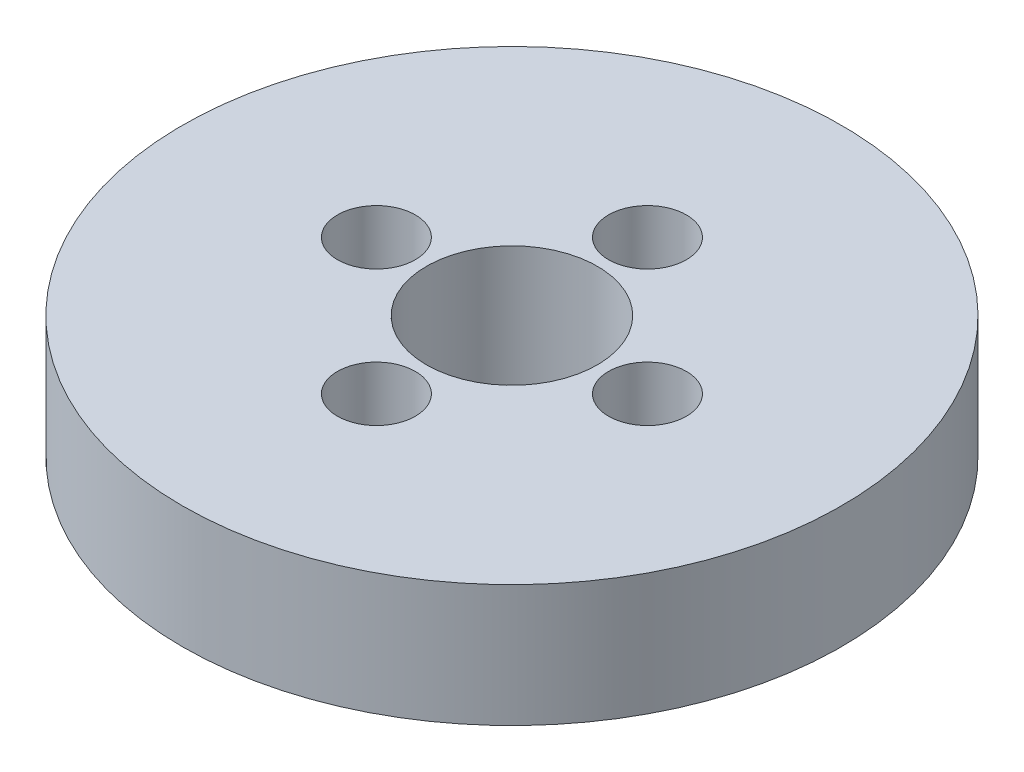
ISO-10303-21;
HEADER;
FILE_DESCRIPTION(('STEP AP214'),'2;1');
FILE_NAME('part.step','',(''),(''),'','','');
FILE_SCHEMA(('AUTOMOTIVE_DESIGN { 1 0 10303 214 1 1 1 1 }'));
ENDSEC;
DATA;
#1=APPLICATION_CONTEXT('core data for automotive mechanical design processes');
#2=APPLICATION_PROTOCOL_DEFINITION('international standard','automotive_design',2000,#1);
#3=PRODUCT_CONTEXT('',#1,'mechanical');
#4=PRODUCT('Part','Part','',(#3));
#5=PRODUCT_RELATED_PRODUCT_CATEGORY('part','',(#4));
#6=PRODUCT_DEFINITION_FORMATION('','',#4);
#7=PRODUCT_DEFINITION_CONTEXT('part definition',#1,'design');
#8=PRODUCT_DEFINITION('design','',#6,#7);
#9=PRODUCT_DEFINITION_SHAPE('','',#8);
#10=(LENGTH_UNIT() NAMED_UNIT(*) SI_UNIT(.MILLI.,.METRE.));
#11=(NAMED_UNIT(*) PLANE_ANGLE_UNIT() SI_UNIT($,.RADIAN.));
#12=(NAMED_UNIT(*) SI_UNIT($,.STERADIAN.) SOLID_ANGLE_UNIT());
#13=UNCERTAINTY_MEASURE_WITH_UNIT(LENGTH_MEASURE(1.E-05),#10,'distance_accuracy_value','');
#14=(GEOMETRIC_REPRESENTATION_CONTEXT(3) GLOBAL_UNCERTAINTY_ASSIGNED_CONTEXT((#13)) GLOBAL_UNIT_ASSIGNED_CONTEXT((#10,
#11,#12)) REPRESENTATION_CONTEXT('',''));
#15=CARTESIAN_POINT('',(0.,0.,0.));
#16=DIRECTION('',(0.,0.,1.));
#17=DIRECTION('',(1.,0.,0.));
#18=AXIS2_PLACEMENT_3D('',#15,#16,#17);
#19=CARTESIAN_POINT('',(0.,25.,0.));
#20=DIRECTION('',(0.,-1.,0.));
#21=DIRECTION('',(0.,0.,-1.));
#22=AXIS2_PLACEMENT_3D('',#19,#20,#21);
#23=CYLINDRICAL_SURFACE('',#22,67.5);
#24=CARTESIAN_POINT('',(0.,25.,0.));
#25=DIRECTION('',(0.,1.,0.));
#26=DIRECTION('',(0.,0.,1.));
#27=AXIS2_PLACEMENT_3D('',#24,#25,#26);
#28=CIRCLE('',#27,67.5);
#29=CARTESIAN_POINT('',(0.,25.,67.5));
#30=VERTEX_POINT('',#29);
#31=EDGE_CURVE('E10',#30,#30,#28,.T.);
#32=ORIENTED_EDGE('',*,*,#31,.F.);
#33=EDGE_LOOP('',(#32));
#34=FACE_BOUND('',#33,.T.);
#35=CARTESIAN_POINT('',(0.,0.,0.));
#36=DIRECTION('',(0.,1.,0.));
#37=DIRECTION('',(0.,0.,1.));
#38=AXIS2_PLACEMENT_3D('',#35,#36,#37);
#39=CIRCLE('',#38,67.5);
#40=CARTESIAN_POINT('',(0.,0.,67.5));
#41=VERTEX_POINT('',#40);
#42=EDGE_CURVE('E37',#41,#41,#39,.T.);
#43=ORIENTED_EDGE('',*,*,#42,.T.);
#44=EDGE_LOOP('',(#43));
#45=FACE_BOUND('',#44,.T.);
#46=ADVANCED_FACE('F40',(#34,#45),#23,.T.);
#47=CARTESIAN_POINT('',(0.,25.,0.));
#48=DIRECTION('',(0.,1.,0.));
#49=DIRECTION('',(0.,0.,1.));
#50=AXIS2_PLACEMENT_3D('',#47,#48,#49);
#51=PLANE('',#50);
#52=CARTESIAN_POINT('',(0.,25.,27.7595017120129));
#53=DIRECTION('',(0.,1.,0.));
#54=DIRECTION('',(1.,0.,0.));
#55=AXIS2_PLACEMENT_3D('',#52,#53,#54);
#56=CIRCLE('',#55,7.96956297823244);
#57=CARTESIAN_POINT('',(7.96956297823253,25.,27.7595017120129));
#58=VERTEX_POINT('',#57);
#59=EDGE_CURVE('E71',#58,#58,#56,.T.);
#60=ORIENTED_EDGE('',*,*,#59,.F.);
#61=EDGE_LOOP('',(#60));
#62=FACE_BOUND('',#61,.T.);
#63=CARTESIAN_POINT('',(27.7595017120129,25.,0.));
#64=DIRECTION('',(0.,1.,0.));
#65=DIRECTION('',(0.,0.,-1.));
#66=AXIS2_PLACEMENT_3D('',#63,#64,#65);
#67=CIRCLE('',#66,7.96956297823244);
#68=CARTESIAN_POINT('',(27.7595017120129,25.,-7.96956297823244));
#69=VERTEX_POINT('',#68);
#70=EDGE_CURVE('E70',#69,#69,#67,.T.);
#71=ORIENTED_EDGE('',*,*,#70,.F.);
#72=EDGE_LOOP('',(#71));
#73=FACE_BOUND('',#72,.T.);
#74=CARTESIAN_POINT('',(-2.90765346609231E-13,25.,-27.7595017120129));
#75=DIRECTION('',(0.,1.,0.));
#76=DIRECTION('',(-1.,0.,0.));
#77=AXIS2_PLACEMENT_3D('',#74,#75,#76);
#78=CIRCLE('',#77,7.96956297823244);
#79=CARTESIAN_POINT('',(-7.96956297823273,25.,-27.7595017120128));
#80=VERTEX_POINT('',#79);
#81=EDGE_CURVE('E61',#80,#80,#78,.T.);
#82=ORIENTED_EDGE('',*,*,#81,.F.);
#83=EDGE_LOOP('',(#82));
#84=FACE_BOUND('',#83,.T.);
#85=CARTESIAN_POINT('',(-27.7595017120129,25.,0.));
#86=DIRECTION('',(0.,1.,0.));
#87=DIRECTION('',(0.,0.,1.));
#88=AXIS2_PLACEMENT_3D('',#85,#86,#87);
#89=CIRCLE('',#88,7.96956297823244);
#90=CARTESIAN_POINT('',(-27.7595017120129,25.,7.96956297823244));
#91=VERTEX_POINT('',#90);
#92=EDGE_CURVE('E54',#91,#91,#89,.T.);
#93=ORIENTED_EDGE('',*,*,#92,.F.);
#94=EDGE_LOOP('',(#93));
#95=FACE_BOUND('',#94,.T.);
#96=CARTESIAN_POINT('',(0.,25.,0.));
#97=DIRECTION('',(0.,1.,0.));
#98=DIRECTION('',(0.,0.,1.));
#99=AXIS2_PLACEMENT_3D('',#96,#97,#98);
#100=CIRCLE('',#99,17.5);
#101=CARTESIAN_POINT('',(0.,25.,17.5));
#102=VERTEX_POINT('',#101);
#103=EDGE_CURVE('E50',#102,#102,#100,.T.);
#104=ORIENTED_EDGE('',*,*,#103,.F.);
#105=EDGE_LOOP('',(#104));
#106=FACE_BOUND('',#105,.T.);
#107=ORIENTED_EDGE('',*,*,#31,.T.);
#108=EDGE_LOOP('',(#107));
#109=FACE_BOUND('',#108,.T.);
#110=ADVANCED_FACE('F86',(#62,#73,#84,#95,#106,#109),#51,.T.);
#111=CARTESIAN_POINT('',(0.,0.,0.));
#112=DIRECTION('',(0.,1.,0.));
#113=DIRECTION('',(0.,0.,1.));
#114=AXIS2_PLACEMENT_3D('',#111,#112,#113);
#115=PLANE('',#114);
#116=CARTESIAN_POINT('',(0.,0.,0.));
#117=DIRECTION('',(0.,1.,0.));
#118=DIRECTION('',(0.,0.,1.));
#119=AXIS2_PLACEMENT_3D('',#116,#117,#118);
#120=CIRCLE('',#119,17.5);
#121=CARTESIAN_POINT('',(0.,0.,17.5));
#122=VERTEX_POINT('',#121);
#123=EDGE_CURVE('E47',#122,#122,#120,.T.);
#124=ORIENTED_EDGE('',*,*,#123,.T.);
#125=EDGE_LOOP('',(#124));
#126=FACE_BOUND('',#125,.T.);
#127=ORIENTED_EDGE('',*,*,#42,.F.);
#128=EDGE_LOOP('',(#127));
#129=FACE_BOUND('',#128,.T.);
#130=ADVANCED_FACE('F93',(#126,#129),#115,.F.);
#131=CARTESIAN_POINT('',(0.,25.,0.));
#132=DIRECTION('',(0.,-1.,0.));
#133=DIRECTION('',(0.,0.,-1.));
#134=AXIS2_PLACEMENT_3D('',#131,#132,#133);
#135=CYLINDRICAL_SURFACE('',#134,17.5);
#136=ORIENTED_EDGE('',*,*,#103,.T.);
#137=EDGE_LOOP('',(#136));
#138=FACE_BOUND('',#137,.T.);
#139=ORIENTED_EDGE('',*,*,#123,.F.);
#140=EDGE_LOOP('',(#139));
#141=FACE_BOUND('',#140,.T.);
#142=ADVANCED_FACE('F101',(#138,#141),#135,.F.);
#143=CARTESIAN_POINT('',(-27.7595017120129,3.7241382286134,0.));
#144=DIRECTION('',(0.,1.,0.));
#145=DIRECTION('',(0.,0.,1.));
#146=AXIS2_PLACEMENT_3D('',#143,#144,#145);
#147=CYLINDRICAL_SURFACE('',#146,7.96956297823244);
#148=CARTESIAN_POINT('',(-27.7595017120129,3.7241382286134,0.));
#149=DIRECTION('',(0.,1.,0.));
#150=DIRECTION('',(0.,0.,1.));
#151=AXIS2_PLACEMENT_3D('',#148,#149,#150);
#152=CIRCLE('',#151,7.96956297823244);
#153=CARTESIAN_POINT('',(-27.7595017120129,3.7241382286134,7.96956297823244));
#154=VERTEX_POINT('',#153);
#155=EDGE_CURVE('E55',#154,#154,#152,.T.);
#156=ORIENTED_EDGE('',*,*,#155,.F.);
#157=EDGE_LOOP('',(#156));
#158=FACE_BOUND('',#157,.T.);
#159=ORIENTED_EDGE('',*,*,#92,.T.);
#160=EDGE_LOOP('',(#159));
#161=FACE_BOUND('',#160,.T.);
#162=ADVANCED_FACE('F102',(#158,#161),#147,.F.);
#163=CARTESIAN_POINT('',(-27.7595017120129,3.7241382286134,0.));
#164=DIRECTION('',(0.,1.,0.));
#165=DIRECTION('',(0.,0.,1.));
#166=AXIS2_PLACEMENT_3D('',#163,#164,#165);
#167=PLANE('',#166);
#168=ORIENTED_EDGE('',*,*,#155,.T.);
#169=EDGE_LOOP('',(#168));
#170=FACE_BOUND('',#169,.T.);
#171=ADVANCED_FACE('F133',(#170),#167,.T.);
#172=CARTESIAN_POINT('',(-2.90765346609231E-13,3.7241382286134,-27.7595017120129));
#173=DIRECTION('',(0.,1.,0.));
#174=DIRECTION('',(0.,0.,1.));
#175=AXIS2_PLACEMENT_3D('',#172,#173,#174);
#176=CYLINDRICAL_SURFACE('',#175,7.96956297823244);
#177=CARTESIAN_POINT('',(-2.90765346609231E-13,3.7241382286134,-27.7595017120129));
#178=DIRECTION('',(0.,1.,0.));
#179=DIRECTION('',(-1.,0.,0.));
#180=AXIS2_PLACEMENT_3D('',#177,#178,#179);
#181=CIRCLE('',#180,7.96956297823244);
#182=CARTESIAN_POINT('',(-7.96956297823273,3.7241382286134,-27.7595017120128));
#183=VERTEX_POINT('',#182);
#184=EDGE_CURVE('E63',#183,#183,#181,.T.);
#185=ORIENTED_EDGE('',*,*,#184,.F.);
#186=EDGE_LOOP('',(#185));
#187=FACE_BOUND('',#186,.T.);
#188=ORIENTED_EDGE('',*,*,#81,.T.);
#189=EDGE_LOOP('',(#188));
#190=FACE_BOUND('',#189,.T.);
#191=ADVANCED_FACE('F142',(#187,#190),#176,.F.);
#192=CARTESIAN_POINT('',(-2.90765346609231E-13,3.7241382286134,-27.7595017120129));
#193=DIRECTION('',(0.,1.,0.));
#194=DIRECTION('',(-1.,0.,0.));
#195=AXIS2_PLACEMENT_3D('',#192,#193,#194);
#196=PLANE('',#195);
#197=ORIENTED_EDGE('',*,*,#184,.T.);
#198=EDGE_LOOP('',(#197));
#199=FACE_BOUND('',#198,.T.);
#200=ADVANCED_FACE('F156',(#199),#196,.T.);
#201=CARTESIAN_POINT('',(27.7595017120129,3.7241382286134,0.));
#202=DIRECTION('',(0.,1.,0.));
#203=DIRECTION('',(0.,0.,1.));
#204=AXIS2_PLACEMENT_3D('',#201,#202,#203);
#205=CYLINDRICAL_SURFACE('',#204,7.96956297823244);
#206=CARTESIAN_POINT('',(27.7595017120129,3.7241382286134,0.));
#207=DIRECTION('',(0.,1.,0.));
#208=DIRECTION('',(0.,0.,-1.));
#209=AXIS2_PLACEMENT_3D('',#206,#207,#208);
#210=CIRCLE('',#209,7.96956297823244);
#211=CARTESIAN_POINT('',(27.7595017120129,3.7241382286134,-7.96956297823244));
#212=VERTEX_POINT('',#211);
#213=EDGE_CURVE('E69',#212,#212,#210,.T.);
#214=ORIENTED_EDGE('',*,*,#213,.F.);
#215=EDGE_LOOP('',(#214));
#216=FACE_BOUND('',#215,.T.);
#217=ORIENTED_EDGE('',*,*,#70,.T.);
#218=EDGE_LOOP('',(#217));
#219=FACE_BOUND('',#218,.T.);
#220=ADVANCED_FACE('F164',(#216,#219),#205,.F.);
#221=CARTESIAN_POINT('',(27.7595017120129,3.7241382286134,0.));
#222=DIRECTION('',(0.,1.,0.));
#223=DIRECTION('',(0.,0.,-1.));
#224=AXIS2_PLACEMENT_3D('',#221,#222,#223);
#225=PLANE('',#224);
#226=ORIENTED_EDGE('',*,*,#213,.T.);
#227=EDGE_LOOP('',(#226));
#228=FACE_BOUND('',#227,.T.);
#229=ADVANCED_FACE('F83',(#228),#225,.T.);
#230=CARTESIAN_POINT('',(0.,3.7241382286134,27.7595017120129));
#231=DIRECTION('',(0.,1.,0.));
#232=DIRECTION('',(0.,0.,1.));
#233=AXIS2_PLACEMENT_3D('',#230,#231,#232);
#234=CYLINDRICAL_SURFACE('',#233,7.96956297823244);
#235=CARTESIAN_POINT('',(0.,3.7241382286134,27.7595017120129));
#236=DIRECTION('',(0.,1.,0.));
#237=DIRECTION('',(1.,0.,0.));
#238=AXIS2_PLACEMENT_3D('',#235,#236,#237);
#239=CIRCLE('',#238,7.96956297823244);
#240=CARTESIAN_POINT('',(7.96956297823253,3.7241382286134,27.7595017120129));
#241=VERTEX_POINT('',#240);
#242=EDGE_CURVE('E59',#241,#241,#239,.T.);
#243=ORIENTED_EDGE('',*,*,#242,.F.);
#244=EDGE_LOOP('',(#243));
#245=FACE_BOUND('',#244,.T.);
#246=ORIENTED_EDGE('',*,*,#59,.T.);
#247=EDGE_LOOP('',(#246));
#248=FACE_BOUND('',#247,.T.);
#249=ADVANCED_FACE('F81',(#245,#248),#234,.F.);
#250=CARTESIAN_POINT('',(0.,3.7241382286134,27.7595017120129));
#251=DIRECTION('',(0.,1.,0.));
#252=DIRECTION('',(1.,0.,0.));
#253=AXIS2_PLACEMENT_3D('',#250,#251,#252);
#254=PLANE('',#253);
#255=ORIENTED_EDGE('',*,*,#242,.T.);
#256=EDGE_LOOP('',(#255));
#257=FACE_BOUND('',#256,.T.);
#258=ADVANCED_FACE('F78',(#257),#254,.T.);
#259=CLOSED_SHELL('',(#46,#110,#130,#142,#162,#171,#191,#200,#220,#229,#249,#258));
#260=MANIFOLD_SOLID_BREP('B2',#259);
#261=ADVANCED_BREP_SHAPE_REPRESENTATION('',(#18,#260),#14);
#262=SHAPE_DEFINITION_REPRESENTATION(#9,#261);
ENDSEC;
END-ISO-10303-21;
